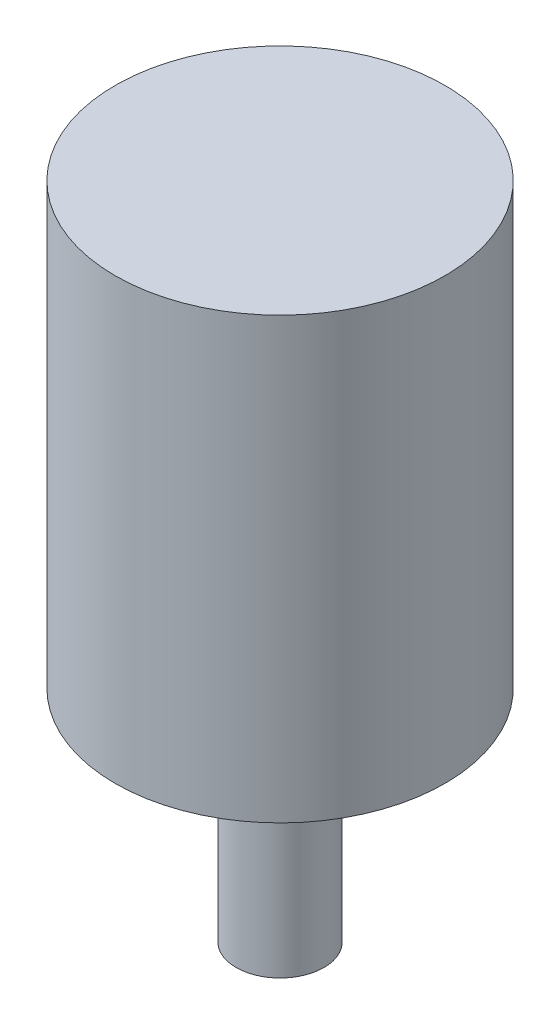
ISO-10303-21;
HEADER;
FILE_DESCRIPTION(('STEP AP214'),'2;1');
FILE_NAME('part.step','',(''),(''),'','','');
FILE_SCHEMA(('AUTOMOTIVE_DESIGN { 1 0 10303 214 1 1 1 1 }'));
ENDSEC;
DATA;
#1=APPLICATION_CONTEXT('core data for automotive mechanical design processes');
#2=APPLICATION_PROTOCOL_DEFINITION('international standard','automotive_design',2000,#1);
#3=PRODUCT_CONTEXT('',#1,'mechanical');
#4=PRODUCT('Part','Part','',(#3));
#5=PRODUCT_RELATED_PRODUCT_CATEGORY('part','',(#4));
#6=PRODUCT_DEFINITION_FORMATION('','',#4);
#7=PRODUCT_DEFINITION_CONTEXT('part definition',#1,'design');
#8=PRODUCT_DEFINITION('design','',#6,#7);
#9=PRODUCT_DEFINITION_SHAPE('','',#8);
#10=(LENGTH_UNIT() NAMED_UNIT(*) SI_UNIT(.MILLI.,.METRE.));
#11=(NAMED_UNIT(*) PLANE_ANGLE_UNIT() SI_UNIT($,.RADIAN.));
#12=(NAMED_UNIT(*) SI_UNIT($,.STERADIAN.) SOLID_ANGLE_UNIT());
#13=UNCERTAINTY_MEASURE_WITH_UNIT(LENGTH_MEASURE(1.E-05),#10,'distance_accuracy_value','');
#14=(GEOMETRIC_REPRESENTATION_CONTEXT(3) GLOBAL_UNCERTAINTY_ASSIGNED_CONTEXT((#13)) GLOBAL_UNIT_ASSIGNED_CONTEXT((#10,
#11,#12)) REPRESENTATION_CONTEXT('',''));
#15=CARTESIAN_POINT('',(0.,0.,0.));
#16=DIRECTION('',(0.,0.,1.));
#17=DIRECTION('',(1.,0.,0.));
#18=AXIS2_PLACEMENT_3D('',#15,#16,#17);
#19=CARTESIAN_POINT('',(0.,0.,0.));
#20=DIRECTION('',(0.,1.,0.));
#21=DIRECTION('',(0.,0.,1.));
#22=AXIS2_PLACEMENT_3D('',#19,#20,#21);
#23=PLANE('',#22);
#24=CARTESIAN_POINT('',(0.,0.,0.));
#25=DIRECTION('',(0.,1.,0.));
#26=DIRECTION('',(0.,0.,1.));
#27=AXIS2_PLACEMENT_3D('',#24,#25,#26);
#28=CIRCLE('',#27,0.375);
#29=CARTESIAN_POINT('',(0.,0.,0.375));
#30=VERTEX_POINT('',#29);
#31=EDGE_CURVE('E45',#30,#30,#28,.T.);
#32=ORIENTED_EDGE('',*,*,#31,.F.);
#33=EDGE_LOOP('',(#32));
#34=FACE_BOUND('',#33,.T.);
#35=CARTESIAN_POINT('',(0.,0.,0.));
#36=DIRECTION('',(0.,1.,0.));
#37=DIRECTION('',(0.,0.,1.));
#38=AXIS2_PLACEMENT_3D('',#35,#36,#37);
#39=CIRCLE('',#38,0.1);
#40=CARTESIAN_POINT('',(0.,0.,0.1));
#41=VERTEX_POINT('',#40);
#42=EDGE_CURVE('E10',#41,#41,#39,.F.);
#43=ORIENTED_EDGE('',*,*,#42,.F.);
#44=EDGE_LOOP('',(#43));
#45=FACE_BOUND('',#44,.T.);
#46=ADVANCED_FACE('F34',(#34,#45),#23,.F.);
#47=CARTESIAN_POINT('',(0.,1.,0.));
#48=DIRECTION('',(0.,-1.,0.));
#49=DIRECTION('',(0.,0.,-1.));
#50=AXIS2_PLACEMENT_3D('',#47,#48,#49);
#51=CYLINDRICAL_SURFACE('',#50,0.375);
#52=CARTESIAN_POINT('',(0.,1.,0.));
#53=DIRECTION('',(0.,1.,0.));
#54=DIRECTION('',(0.,0.,1.));
#55=AXIS2_PLACEMENT_3D('',#52,#53,#54);
#56=CIRCLE('',#55,0.375);
#57=CARTESIAN_POINT('',(0.,1.,0.375));
#58=VERTEX_POINT('',#57);
#59=EDGE_CURVE('E41',#58,#58,#56,.T.);
#60=ORIENTED_EDGE('',*,*,#59,.F.);
#61=EDGE_LOOP('',(#60));
#62=FACE_BOUND('',#61,.T.);
#63=ORIENTED_EDGE('',*,*,#31,.T.);
#64=EDGE_LOOP('',(#63));
#65=FACE_BOUND('',#64,.T.);
#66=ADVANCED_FACE('F36',(#62,#65),#51,.T.);
#67=CARTESIAN_POINT('',(0.,1.,0.));
#68=DIRECTION('',(0.,1.,0.));
#69=DIRECTION('',(0.,0.,1.));
#70=AXIS2_PLACEMENT_3D('',#67,#68,#69);
#71=PLANE('',#70);
#72=ORIENTED_EDGE('',*,*,#59,.T.);
#73=EDGE_LOOP('',(#72));
#74=FACE_BOUND('',#73,.T.);
#75=ADVANCED_FACE('F59',(#74),#71,.T.);
#76=CARTESIAN_POINT('',(0.,-0.5,0.));
#77=DIRECTION('',(0.,1.,0.));
#78=DIRECTION('',(0.,0.,1.));
#79=AXIS2_PLACEMENT_3D('',#76,#77,#78);
#80=CYLINDRICAL_SURFACE('',#79,0.1);
#81=CARTESIAN_POINT('',(0.,-0.5,0.));
#82=DIRECTION('',(0.,-1.,0.));
#83=DIRECTION('',(0.,0.,-1.));
#84=AXIS2_PLACEMENT_3D('',#81,#82,#83);
#85=CIRCLE('',#84,0.1);
#86=CARTESIAN_POINT('',(0.,-0.5,-0.1));
#87=VERTEX_POINT('',#86);
#88=EDGE_CURVE('E50',#87,#87,#85,.T.);
#89=ORIENTED_EDGE('',*,*,#88,.F.);
#90=EDGE_LOOP('',(#89));
#91=FACE_BOUND('',#90,.T.);
#92=ORIENTED_EDGE('',*,*,#42,.T.);
#93=EDGE_LOOP('',(#92));
#94=FACE_BOUND('',#93,.T.);
#95=ADVANCED_FACE('F57',(#91,#94),#80,.T.);
#96=CARTESIAN_POINT('',(0.,-0.5,0.));
#97=DIRECTION('',(0.,-1.,0.));
#98=DIRECTION('',(0.,0.,-1.));
#99=AXIS2_PLACEMENT_3D('',#96,#97,#98);
#100=PLANE('',#99);
#101=ORIENTED_EDGE('',*,*,#88,.T.);
#102=EDGE_LOOP('',(#101));
#103=FACE_BOUND('',#102,.T.);
#104=ADVANCED_FACE('F55',(#103),#100,.T.);
#105=CLOSED_SHELL('',(#46,#66,#75,#95,#104));
#106=MANIFOLD_SOLID_BREP('B2',#105);
#107=ADVANCED_BREP_SHAPE_REPRESENTATION('',(#18,#106),#14);
#108=SHAPE_DEFINITION_REPRESENTATION(#9,#107);
ENDSEC;
END-ISO-10303-21;
